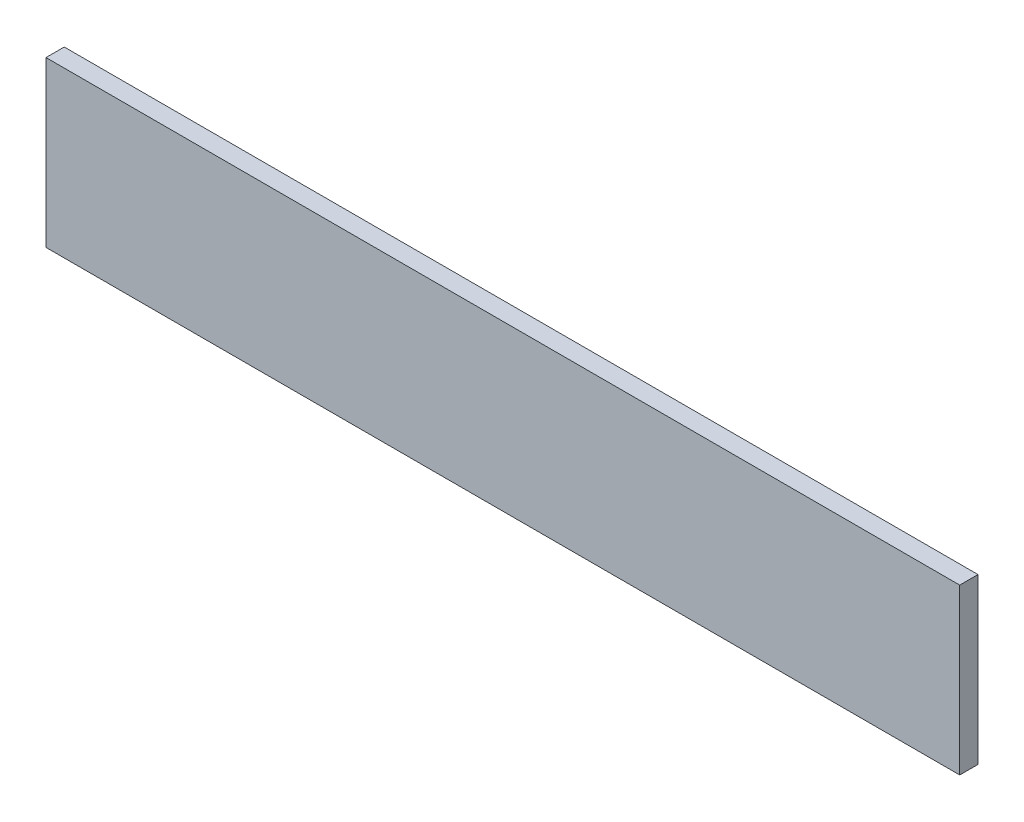
ISO-10303-21;
HEADER;
FILE_DESCRIPTION(('STEP AP214'),'2;1');
FILE_NAME('part.step','',(''),(''),'','','');
FILE_SCHEMA(('AUTOMOTIVE_DESIGN { 1 0 10303 214 1 1 1 1 }'));
ENDSEC;
DATA;
#1=APPLICATION_CONTEXT('core data for automotive mechanical design processes');
#2=APPLICATION_PROTOCOL_DEFINITION('international standard','automotive_design',2000,#1);
#3=PRODUCT_CONTEXT('',#1,'mechanical');
#4=PRODUCT('Part','Part','',(#3));
#5=PRODUCT_RELATED_PRODUCT_CATEGORY('part','',(#4));
#6=PRODUCT_DEFINITION_FORMATION('','',#4);
#7=PRODUCT_DEFINITION_CONTEXT('part definition',#1,'design');
#8=PRODUCT_DEFINITION('design','',#6,#7);
#9=PRODUCT_DEFINITION_SHAPE('','',#8);
#10=(LENGTH_UNIT() NAMED_UNIT(*) SI_UNIT(.MILLI.,.METRE.));
#11=(NAMED_UNIT(*) PLANE_ANGLE_UNIT() SI_UNIT($,.RADIAN.));
#12=(NAMED_UNIT(*) SI_UNIT($,.STERADIAN.) SOLID_ANGLE_UNIT());
#13=UNCERTAINTY_MEASURE_WITH_UNIT(LENGTH_MEASURE(1.E-05),#10,'distance_accuracy_value','');
#14=(GEOMETRIC_REPRESENTATION_CONTEXT(3) GLOBAL_UNCERTAINTY_ASSIGNED_CONTEXT((#13)) GLOBAL_UNIT_ASSIGNED_CONTEXT((#10,
#11,#12)) REPRESENTATION_CONTEXT('',''));
#15=CARTESIAN_POINT('',(0.,0.,0.));
#16=DIRECTION('',(0.,0.,1.));
#17=DIRECTION('',(1.,0.,0.));
#18=AXIS2_PLACEMENT_3D('',#15,#16,#17);
#19=CARTESIAN_POINT('',(317.5,-57.15,12.7));
#20=DIRECTION('',(-1.,0.,0.));
#21=DIRECTION('',(0.,0.,1.));
#22=AXIS2_PLACEMENT_3D('',#19,#20,#21);
#23=PLANE('',#22);
#24=DIRECTION('',(0.,1.,0.));
#25=VECTOR('',#24,1.);
#26=CARTESIAN_POINT('',(317.5,-57.15,0.));
#27=LINE('',#26,#25);
#28=CARTESIAN_POINT('',(317.5,-57.15,0.));
#29=VERTEX_POINT('',#28);
#30=CARTESIAN_POINT('',(317.5,57.15,0.));
#31=VERTEX_POINT('',#30);
#32=EDGE_CURVE('E96',#29,#31,#27,.T.);
#33=ORIENTED_EDGE('',*,*,#32,.T.);
#34=DIRECTION('',(0.,0.,-1.));
#35=VECTOR('',#34,1.);
#36=CARTESIAN_POINT('',(317.5,57.15,12.7));
#37=LINE('',#36,#35);
#38=CARTESIAN_POINT('',(317.5,57.15,12.7));
#39=VERTEX_POINT('',#38);
#40=EDGE_CURVE('E11',#39,#31,#37,.T.);
#41=ORIENTED_EDGE('',*,*,#40,.F.);
#42=DIRECTION('',(0.,1.,0.));
#43=VECTOR('',#42,1.);
#44=CARTESIAN_POINT('',(317.5,-57.15,12.7));
#45=LINE('',#44,#43);
#46=CARTESIAN_POINT('',(317.5,-57.15,12.7));
#47=VERTEX_POINT('',#46);
#48=EDGE_CURVE('E84',#47,#39,#45,.T.);
#49=ORIENTED_EDGE('',*,*,#48,.F.);
#50=DIRECTION('',(0.,0.,-1.));
#51=VECTOR('',#50,1.);
#52=CARTESIAN_POINT('',(317.5,-57.15,12.7));
#53=LINE('',#52,#51);
#54=EDGE_CURVE('E92',#47,#29,#53,.T.);
#55=ORIENTED_EDGE('',*,*,#54,.T.);
#56=EDGE_LOOP('',(#33,#41,#49,#55));
#57=FACE_BOUND('',#56,.T.);
#58=ADVANCED_FACE('F33',(#57),#23,.F.);
#59=CARTESIAN_POINT('',(-317.5,57.15,12.7));
#60=DIRECTION('',(0.,-1.,0.));
#61=DIRECTION('',(0.,0.,-1.));
#62=AXIS2_PLACEMENT_3D('',#59,#60,#61);
#63=PLANE('',#62);
#64=DIRECTION('',(-1.,0.,0.));
#65=VECTOR('',#64,1.);
#66=CARTESIAN_POINT('',(-317.5,57.15,0.));
#67=LINE('',#66,#65);
#68=CARTESIAN_POINT('',(-317.5,57.15,0.));
#69=VERTEX_POINT('',#68);
#70=EDGE_CURVE('E88',#31,#69,#67,.T.);
#71=ORIENTED_EDGE('',*,*,#70,.T.);
#72=DIRECTION('',(0.,0.,-1.));
#73=VECTOR('',#72,1.);
#74=CARTESIAN_POINT('',(-317.5,57.15,12.7));
#75=LINE('',#74,#73);
#76=CARTESIAN_POINT('',(-317.5,57.15,12.7));
#77=VERTEX_POINT('',#76);
#78=EDGE_CURVE('E41',#77,#69,#75,.T.);
#79=ORIENTED_EDGE('',*,*,#78,.F.);
#80=DIRECTION('',(-1.,0.,0.));
#81=VECTOR('',#80,1.);
#82=CARTESIAN_POINT('',(-317.5,57.15,12.7));
#83=LINE('',#82,#81);
#84=EDGE_CURVE('E79',#39,#77,#83,.T.);
#85=ORIENTED_EDGE('',*,*,#84,.F.);
#86=ORIENTED_EDGE('',*,*,#40,.T.);
#87=EDGE_LOOP('',(#71,#79,#85,#86));
#88=FACE_BOUND('',#87,.T.);
#89=ADVANCED_FACE('F87',(#88),#63,.F.);
#90=CARTESIAN_POINT('',(-317.5,-57.15,12.7));
#91=DIRECTION('',(1.,0.,0.));
#92=DIRECTION('',(0.,0.,-1.));
#93=AXIS2_PLACEMENT_3D('',#90,#91,#92);
#94=PLANE('',#93);
#95=DIRECTION('',(0.,-1.,0.));
#96=VECTOR('',#95,1.);
#97=CARTESIAN_POINT('',(-317.5,-57.15,0.));
#98=LINE('',#97,#96);
#99=CARTESIAN_POINT('',(-317.5,-57.15,0.));
#100=VERTEX_POINT('',#99);
#101=EDGE_CURVE('E66',#69,#100,#98,.T.);
#102=ORIENTED_EDGE('',*,*,#101,.T.);
#103=DIRECTION('',(0.,0.,-1.));
#104=VECTOR('',#103,1.);
#105=CARTESIAN_POINT('',(-317.5,-57.15,12.7));
#106=LINE('',#105,#104);
#107=CARTESIAN_POINT('',(-317.5,-57.15,12.7));
#108=VERTEX_POINT('',#107);
#109=EDGE_CURVE('E89',#108,#100,#106,.T.);
#110=ORIENTED_EDGE('',*,*,#109,.F.);
#111=DIRECTION('',(0.,-1.,0.));
#112=VECTOR('',#111,1.);
#113=CARTESIAN_POINT('',(-317.5,-57.15,12.7));
#114=LINE('',#113,#112);
#115=EDGE_CURVE('E82',#77,#108,#114,.T.);
#116=ORIENTED_EDGE('',*,*,#115,.F.);
#117=ORIENTED_EDGE('',*,*,#78,.T.);
#118=EDGE_LOOP('',(#102,#110,#116,#117));
#119=FACE_BOUND('',#118,.T.);
#120=ADVANCED_FACE('F90',(#119),#94,.F.);
#121=CARTESIAN_POINT('',(-317.5,-57.15,12.7));
#122=DIRECTION('',(0.,1.,0.));
#123=DIRECTION('',(0.,0.,1.));
#124=AXIS2_PLACEMENT_3D('',#121,#122,#123);
#125=PLANE('',#124);
#126=DIRECTION('',(1.,0.,0.));
#127=VECTOR('',#126,1.);
#128=CARTESIAN_POINT('',(-317.5,-57.15,0.));
#129=LINE('',#128,#127);
#130=EDGE_CURVE('E72',#100,#29,#129,.T.);
#131=ORIENTED_EDGE('',*,*,#130,.T.);
#132=ORIENTED_EDGE('',*,*,#54,.F.);
#133=DIRECTION('',(1.,0.,0.));
#134=VECTOR('',#133,1.);
#135=CARTESIAN_POINT('',(-317.5,-57.15,12.7));
#136=LINE('',#135,#134);
#137=EDGE_CURVE('E49',#108,#47,#136,.T.);
#138=ORIENTED_EDGE('',*,*,#137,.F.);
#139=ORIENTED_EDGE('',*,*,#109,.T.);
#140=EDGE_LOOP('',(#131,#132,#138,#139));
#141=FACE_BOUND('',#140,.T.);
#142=ADVANCED_FACE('F103',(#141),#125,.F.);
#143=CARTESIAN_POINT('',(0.,0.,12.7));
#144=DIRECTION('',(0.,0.,-1.));
#145=DIRECTION('',(-1.,0.,0.));
#146=AXIS2_PLACEMENT_3D('',#143,#144,#145);
#147=PLANE('',#146);
#148=ORIENTED_EDGE('',*,*,#48,.T.);
#149=ORIENTED_EDGE('',*,*,#84,.T.);
#150=ORIENTED_EDGE('',*,*,#115,.T.);
#151=ORIENTED_EDGE('',*,*,#137,.T.);
#152=EDGE_LOOP('',(#148,#149,#150,#151));
#153=FACE_BOUND('',#152,.T.);
#154=ADVANCED_FACE('F80',(#153),#147,.F.);
#155=CARTESIAN_POINT('',(0.,0.,0.));
#156=DIRECTION('',(0.,0.,-1.));
#157=DIRECTION('',(-1.,0.,0.));
#158=AXIS2_PLACEMENT_3D('',#155,#156,#157);
#159=PLANE('',#158);
#160=ORIENTED_EDGE('',*,*,#32,.F.);
#161=ORIENTED_EDGE('',*,*,#130,.F.);
#162=ORIENTED_EDGE('',*,*,#101,.F.);
#163=ORIENTED_EDGE('',*,*,#70,.F.);
#164=EDGE_LOOP('',(#160,#161,#162,#163));
#165=FACE_BOUND('',#164,.T.);
#166=ADVANCED_FACE('F106',(#165),#159,.T.);
#167=CLOSED_SHELL('',(#58,#89,#120,#142,#154,#166));
#168=MANIFOLD_SOLID_BREP('B2',#167);
#169=ADVANCED_BREP_SHAPE_REPRESENTATION('',(#18,#168),#14);
#170=SHAPE_DEFINITION_REPRESENTATION(#9,#169);
ENDSEC;
END-ISO-10303-21;
